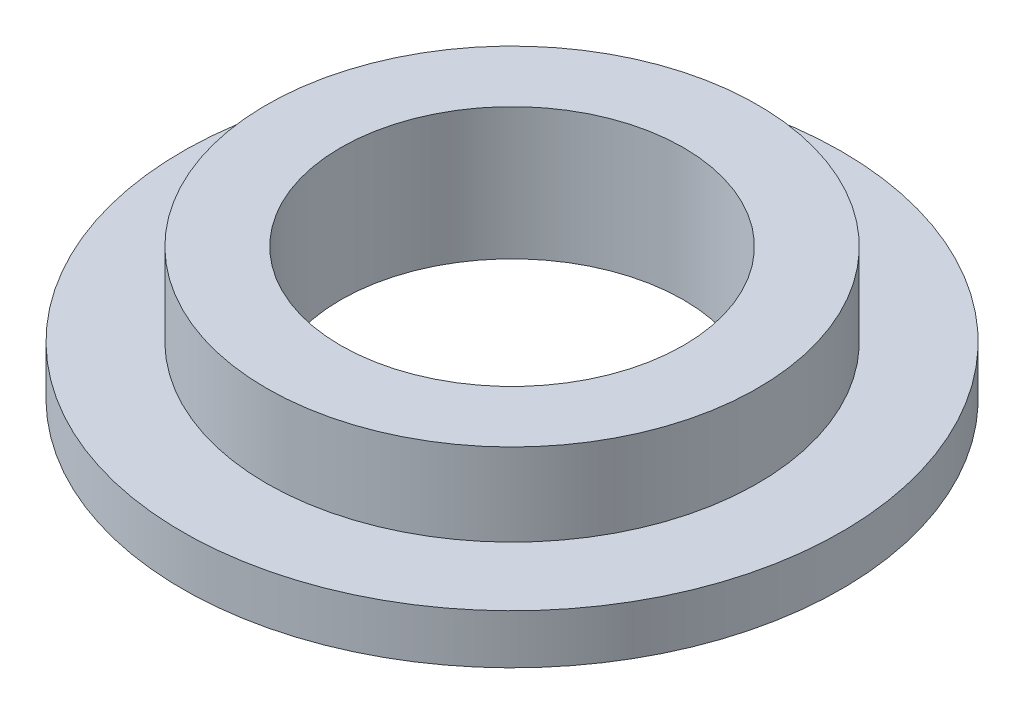
ISO-10303-21;
HEADER;
FILE_DESCRIPTION(('STEP AP214'),'2;1');
FILE_NAME('part.step','',(''),(''),'','','');
FILE_SCHEMA(('AUTOMOTIVE_DESIGN { 1 0 10303 214 1 1 1 1 }'));
ENDSEC;
DATA;
#1=APPLICATION_CONTEXT('core data for automotive mechanical design processes');
#2=APPLICATION_PROTOCOL_DEFINITION('international standard','automotive_design',2000,#1);
#3=PRODUCT_CONTEXT('',#1,'mechanical');
#4=PRODUCT('Part','Part','',(#3));
#5=PRODUCT_RELATED_PRODUCT_CATEGORY('part','',(#4));
#6=PRODUCT_DEFINITION_FORMATION('','',#4);
#7=PRODUCT_DEFINITION_CONTEXT('part definition',#1,'design');
#8=PRODUCT_DEFINITION('design','',#6,#7);
#9=PRODUCT_DEFINITION_SHAPE('','',#8);
#10=(LENGTH_UNIT() NAMED_UNIT(*) SI_UNIT(.MILLI.,.METRE.));
#11=(NAMED_UNIT(*) PLANE_ANGLE_UNIT() SI_UNIT($,.RADIAN.));
#12=(NAMED_UNIT(*) SI_UNIT($,.STERADIAN.) SOLID_ANGLE_UNIT());
#13=UNCERTAINTY_MEASURE_WITH_UNIT(LENGTH_MEASURE(1.E-05),#10,'distance_accuracy_value','');
#14=(GEOMETRIC_REPRESENTATION_CONTEXT(3) GLOBAL_UNCERTAINTY_ASSIGNED_CONTEXT((#13)) GLOBAL_UNIT_ASSIGNED_CONTEXT((#10,
#11,#12)) REPRESENTATION_CONTEXT('',''));
#15=CARTESIAN_POINT('',(0.,0.,0.));
#16=DIRECTION('',(0.,0.,1.));
#17=DIRECTION('',(1.,0.,0.));
#18=AXIS2_PLACEMENT_3D('',#15,#16,#17);
#19=CARTESIAN_POINT('',(0.,5.,0.));
#20=DIRECTION('',(0.,1.,0.));
#21=DIRECTION('',(0.,0.,1.));
#22=AXIS2_PLACEMENT_3D('',#19,#20,#21);
#23=PLANE('',#22);
#24=CARTESIAN_POINT('',(0.,5.,0.));
#25=DIRECTION('',(0.,1.,0.));
#26=DIRECTION('',(0.,0.,1.));
#27=AXIS2_PLACEMENT_3D('',#24,#25,#26);
#28=CIRCLE('',#27,14.9);
#29=CARTESIAN_POINT('',(0.,5.,14.9));
#30=VERTEX_POINT('',#29);
#31=EDGE_CURVE('E10',#30,#30,#28,.T.);
#32=ORIENTED_EDGE('',*,*,#31,.T.);
#33=EDGE_LOOP('',(#32));
#34=FACE_BOUND('',#33,.T.);
#35=CARTESIAN_POINT('',(0.,5.,0.));
#36=DIRECTION('',(0.,1.,0.));
#37=DIRECTION('',(0.,0.,1.));
#38=AXIS2_PLACEMENT_3D('',#35,#36,#37);
#39=CIRCLE('',#38,10.4);
#40=CARTESIAN_POINT('',(0.,5.,10.4));
#41=VERTEX_POINT('',#40);
#42=EDGE_CURVE('E47',#41,#41,#39,.T.);
#43=ORIENTED_EDGE('',*,*,#42,.F.);
#44=EDGE_LOOP('',(#43));
#45=FACE_BOUND('',#44,.T.);
#46=ADVANCED_FACE('F39',(#34,#45),#23,.T.);
#47=CARTESIAN_POINT('',(0.,5.,0.));
#48=DIRECTION('',(0.,-1.,0.));
#49=DIRECTION('',(0.,0.,-1.));
#50=AXIS2_PLACEMENT_3D('',#47,#48,#49);
#51=CYLINDRICAL_SURFACE('',#50,14.9);
#52=ORIENTED_EDGE('',*,*,#31,.F.);
#53=EDGE_LOOP('',(#52));
#54=FACE_BOUND('',#53,.T.);
#55=CARTESIAN_POINT('',(0.,0.,0.));
#56=DIRECTION('',(0.,1.,0.));
#57=DIRECTION('',(0.,0.,1.));
#58=AXIS2_PLACEMENT_3D('',#55,#56,#57);
#59=CIRCLE('',#58,14.9);
#60=CARTESIAN_POINT('',(0.,0.,14.9));
#61=VERTEX_POINT('',#60);
#62=EDGE_CURVE('E43',#61,#61,#59,.T.);
#63=ORIENTED_EDGE('',*,*,#62,.T.);
#64=EDGE_LOOP('',(#63));
#65=FACE_BOUND('',#64,.T.);
#66=ADVANCED_FACE('F41',(#54,#65),#51,.T.);
#67=CARTESIAN_POINT('',(0.,5.,0.));
#68=DIRECTION('',(0.,-1.,0.));
#69=DIRECTION('',(0.,0.,-1.));
#70=AXIS2_PLACEMENT_3D('',#67,#68,#69);
#71=CYLINDRICAL_SURFACE('',#70,10.4);
#72=ORIENTED_EDGE('',*,*,#42,.T.);
#73=EDGE_LOOP('',(#72));
#74=FACE_BOUND('',#73,.T.);
#75=CARTESIAN_POINT('',(0.,-3.,0.));
#76=DIRECTION('',(0.,-1.,0.));
#77=DIRECTION('',(0.,0.,-1.));
#78=AXIS2_PLACEMENT_3D('',#75,#76,#77);
#79=CIRCLE('',#78,10.4);
#80=CARTESIAN_POINT('',(0.,-3.,-10.4));
#81=VERTEX_POINT('',#80);
#82=EDGE_CURVE('E57',#81,#81,#79,.T.);
#83=ORIENTED_EDGE('',*,*,#82,.T.);
#84=EDGE_LOOP('',(#83));
#85=FACE_BOUND('',#84,.T.);
#86=ADVANCED_FACE('F63',(#74,#85),#71,.F.);
#87=CARTESIAN_POINT('',(0.,-3.,0.));
#88=DIRECTION('',(0.,-1.,0.));
#89=DIRECTION('',(0.,0.,-1.));
#90=AXIS2_PLACEMENT_3D('',#87,#88,#89);
#91=PLANE('',#90);
#92=CARTESIAN_POINT('',(0.,-3.,0.));
#93=DIRECTION('',(0.,-1.,0.));
#94=DIRECTION('',(0.,0.,-1.));
#95=AXIS2_PLACEMENT_3D('',#92,#93,#94);
#96=CIRCLE('',#95,20.);
#97=CARTESIAN_POINT('',(0.,-3.,-20.));
#98=VERTEX_POINT('',#97);
#99=EDGE_CURVE('E56',#98,#98,#96,.T.);
#100=ORIENTED_EDGE('',*,*,#99,.T.);
#101=EDGE_LOOP('',(#100));
#102=FACE_BOUND('',#101,.T.);
#103=ORIENTED_EDGE('',*,*,#82,.F.);
#104=EDGE_LOOP('',(#103));
#105=FACE_BOUND('',#104,.T.);
#106=ADVANCED_FACE('F65',(#102,#105),#91,.T.);
#107=CARTESIAN_POINT('',(0.,0.,0.));
#108=DIRECTION('',(0.,-1.,0.));
#109=DIRECTION('',(0.,0.,-1.));
#110=AXIS2_PLACEMENT_3D('',#107,#108,#109);
#111=PLANE('',#110);
#112=ORIENTED_EDGE('',*,*,#62,.F.);
#113=EDGE_LOOP('',(#112));
#114=FACE_BOUND('',#113,.T.);
#115=CARTESIAN_POINT('',(0.,0.,0.));
#116=DIRECTION('',(0.,-1.,0.));
#117=DIRECTION('',(0.,0.,-1.));
#118=AXIS2_PLACEMENT_3D('',#115,#116,#117);
#119=CIRCLE('',#118,20.);
#120=CARTESIAN_POINT('',(0.,0.,-20.));
#121=VERTEX_POINT('',#120);
#122=EDGE_CURVE('E53',#121,#121,#119,.T.);
#123=ORIENTED_EDGE('',*,*,#122,.F.);
#124=EDGE_LOOP('',(#123));
#125=FACE_BOUND('',#124,.T.);
#126=ADVANCED_FACE('F67',(#114,#125),#111,.F.);
#127=CARTESIAN_POINT('',(0.,-3.,0.));
#128=DIRECTION('',(0.,1.,0.));
#129=DIRECTION('',(0.,0.,1.));
#130=AXIS2_PLACEMENT_3D('',#127,#128,#129);
#131=CYLINDRICAL_SURFACE('',#130,20.);
#132=ORIENTED_EDGE('',*,*,#99,.F.);
#133=EDGE_LOOP('',(#132));
#134=FACE_BOUND('',#133,.T.);
#135=ORIENTED_EDGE('',*,*,#122,.T.);
#136=EDGE_LOOP('',(#135));
#137=FACE_BOUND('',#136,.T.);
#138=ADVANCED_FACE('F74',(#134,#137),#131,.T.);
#139=CLOSED_SHELL('',(#46,#66,#86,#106,#126,#138));
#140=MANIFOLD_SOLID_BREP('B2',#139);
#141=ADVANCED_BREP_SHAPE_REPRESENTATION('',(#18,#140),#14);
#142=SHAPE_DEFINITION_REPRESENTATION(#9,#141);
ENDSEC;
END-ISO-10303-21;
